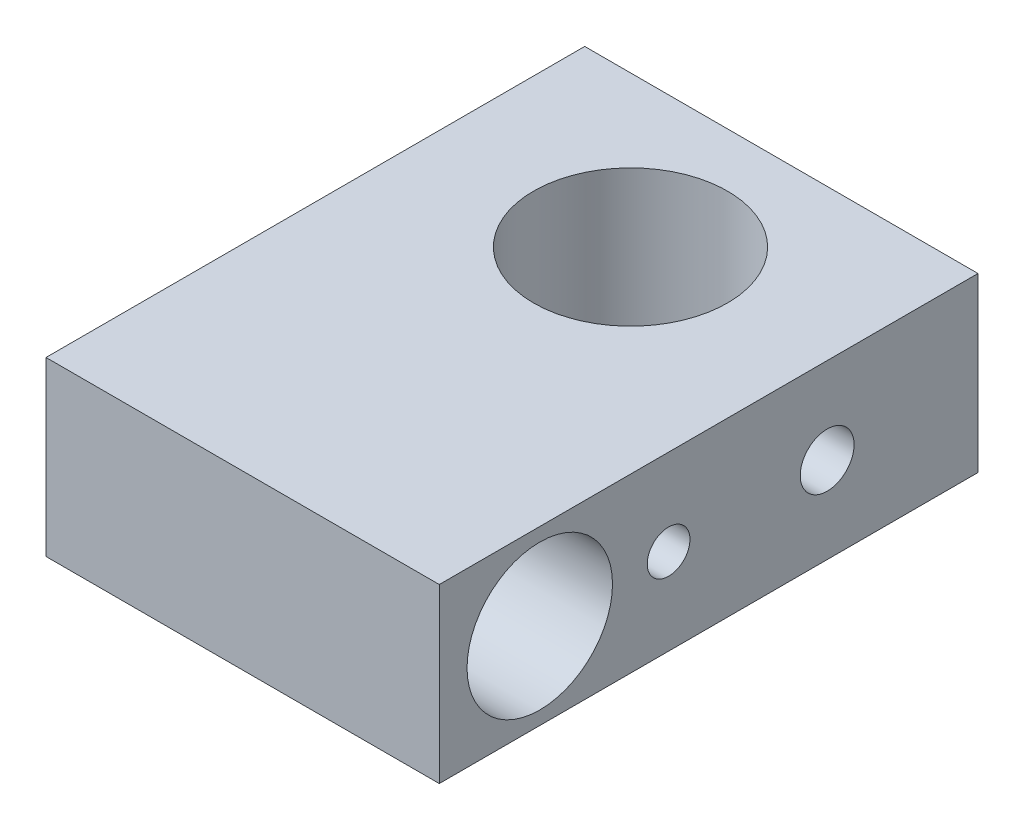
ISO-10303-21;
HEADER;
FILE_DESCRIPTION(('STEP AP214'),'2;1');
FILE_NAME('part.step','',(''),(''),'','','');
FILE_SCHEMA(('AUTOMOTIVE_DESIGN { 1 0 10303 214 1 1 1 1 }'));
ENDSEC;
DATA;
#1=APPLICATION_CONTEXT('core data for automotive mechanical design processes');
#2=APPLICATION_PROTOCOL_DEFINITION('international standard','automotive_design',2000,#1);
#3=PRODUCT_CONTEXT('',#1,'mechanical');
#4=PRODUCT('Part','Part','',(#3));
#5=PRODUCT_RELATED_PRODUCT_CATEGORY('part','',(#4));
#6=PRODUCT_DEFINITION_FORMATION('','',#4);
#7=PRODUCT_DEFINITION_CONTEXT('part definition',#1,'design');
#8=PRODUCT_DEFINITION('design','',#6,#7);
#9=PRODUCT_DEFINITION_SHAPE('','',#8);
#10=(LENGTH_UNIT() NAMED_UNIT(*) SI_UNIT(.MILLI.,.METRE.));
#11=(NAMED_UNIT(*) PLANE_ANGLE_UNIT() SI_UNIT($,.RADIAN.));
#12=(NAMED_UNIT(*) SI_UNIT($,.STERADIAN.) SOLID_ANGLE_UNIT());
#13=UNCERTAINTY_MEASURE_WITH_UNIT(LENGTH_MEASURE(1.E-05),#10,'distance_accuracy_value','');
#14=(GEOMETRIC_REPRESENTATION_CONTEXT(3) GLOBAL_UNCERTAINTY_ASSIGNED_CONTEXT((#13)) GLOBAL_UNIT_ASSIGNED_CONTEXT((#10,
#11,#12)) REPRESENTATION_CONTEXT('',''));
#15=CARTESIAN_POINT('',(0.,0.,0.));
#16=DIRECTION('',(0.,0.,1.));
#17=DIRECTION('',(1.,0.,0.));
#18=AXIS2_PLACEMENT_3D('',#15,#16,#17);
#19=CARTESIAN_POINT('',(-9.125,8.,-7.));
#20=DIRECTION('',(0.,0.,1.));
#21=DIRECTION('',(1.,0.,0.));
#22=AXIS2_PLACEMENT_3D('',#19,#20,#21);
#23=PLANE('',#22);
#24=DIRECTION('',(-1.,0.,0.));
#25=VECTOR('',#24,1.);
#26=CARTESIAN_POINT('',(-9.125,0.,-7.));
#27=LINE('',#26,#25);
#28=CARTESIAN_POINT('',(9.125,0.,-6.99999999999999));
#29=VERTEX_POINT('',#28);
#30=CARTESIAN_POINT('',(-9.125,0.,-7.));
#31=VERTEX_POINT('',#30);
#32=EDGE_CURVE('E117',#29,#31,#27,.T.);
#33=ORIENTED_EDGE('',*,*,#32,.T.);
#34=DIRECTION('',(0.,-1.,0.));
#35=VECTOR('',#34,1.);
#36=CARTESIAN_POINT('',(-9.125,8.,-7.));
#37=LINE('',#36,#35);
#38=CARTESIAN_POINT('',(-9.125,8.,-7.));
#39=VERTEX_POINT('',#38);
#40=EDGE_CURVE('E13',#39,#31,#37,.T.);
#41=ORIENTED_EDGE('',*,*,#40,.F.);
#42=DIRECTION('',(-1.,0.,0.));
#43=VECTOR('',#42,1.);
#44=CARTESIAN_POINT('',(-9.125,8.,-7.));
#45=LINE('',#44,#43);
#46=CARTESIAN_POINT('',(9.125,8.,-6.99999999999999));
#47=VERTEX_POINT('',#46);
#48=EDGE_CURVE('E104',#47,#39,#45,.T.);
#49=ORIENTED_EDGE('',*,*,#48,.F.);
#50=DIRECTION('',(0.,-1.,0.));
#51=VECTOR('',#50,1.);
#52=CARTESIAN_POINT('',(9.125,8.,-6.99999999999999));
#53=LINE('',#52,#51);
#54=EDGE_CURVE('E113',#47,#29,#53,.T.);
#55=ORIENTED_EDGE('',*,*,#54,.T.);
#56=EDGE_LOOP('',(#33,#41,#49,#55));
#57=FACE_BOUND('',#56,.T.);
#58=ADVANCED_FACE('F48',(#57),#23,.F.);
#59=CARTESIAN_POINT('',(-9.125,8.,18.));
#60=DIRECTION('',(1.,0.,0.));
#61=DIRECTION('',(0.,0.,-1.));
#62=AXIS2_PLACEMENT_3D('',#59,#60,#61);
#63=PLANE('',#62);
#64=CARTESIAN_POINT('',(-9.125,4.,7.3575));
#65=DIRECTION('',(1.,0.,0.));
#66=DIRECTION('',(0.,0.,-1.));
#67=AXIS2_PLACEMENT_3D('',#64,#65,#66);
#68=CIRCLE('',#67,0.990599999999999);
#69=CARTESIAN_POINT('',(-9.125,4.,6.3669));
#70=VERTEX_POINT('',#69);
#71=EDGE_CURVE('E140',#70,#70,#68,.T.);
#72=ORIENTED_EDGE('',*,*,#71,.T.);
#73=EDGE_LOOP('',(#72));
#74=FACE_BOUND('',#73,.T.);
#75=CARTESIAN_POINT('',(-9.125,4.,13.336186812336));
#76=DIRECTION('',(1.,0.,0.));
#77=DIRECTION('',(0.,0.,-1.));
#78=AXIS2_PLACEMENT_3D('',#75,#76,#77);
#79=CIRCLE('',#78,3.375);
#80=CARTESIAN_POINT('',(-9.125,4.,9.96118681233597));
#81=VERTEX_POINT('',#80);
#82=EDGE_CURVE('E136',#81,#81,#79,.T.);
#83=ORIENTED_EDGE('',*,*,#82,.T.);
#84=EDGE_LOOP('',(#83));
#85=FACE_BOUND('',#84,.T.);
#86=DIRECTION('',(0.,0.,1.));
#87=VECTOR('',#86,1.);
#88=CARTESIAN_POINT('',(-9.125,0.,18.));
#89=LINE('',#88,#87);
#90=CARTESIAN_POINT('',(-9.125,0.,18.));
#91=VERTEX_POINT('',#90);
#92=EDGE_CURVE('E108',#31,#91,#89,.T.);
#93=ORIENTED_EDGE('',*,*,#92,.T.);
#94=DIRECTION('',(0.,-1.,0.));
#95=VECTOR('',#94,1.);
#96=CARTESIAN_POINT('',(-9.125,8.,18.));
#97=LINE('',#96,#95);
#98=CARTESIAN_POINT('',(-9.125,8.,18.));
#99=VERTEX_POINT('',#98);
#100=EDGE_CURVE('E61',#99,#91,#97,.T.);
#101=ORIENTED_EDGE('',*,*,#100,.F.);
#102=DIRECTION('',(0.,0.,1.));
#103=VECTOR('',#102,1.);
#104=CARTESIAN_POINT('',(-9.125,8.,18.));
#105=LINE('',#104,#103);
#106=EDGE_CURVE('E99',#39,#99,#105,.T.);
#107=ORIENTED_EDGE('',*,*,#106,.F.);
#108=ORIENTED_EDGE('',*,*,#40,.T.);
#109=EDGE_LOOP('',(#93,#101,#107,#108));
#110=FACE_BOUND('',#109,.T.);
#111=ADVANCED_FACE('F107',(#74,#85,#110),#63,.F.);
#112=CARTESIAN_POINT('',(9.125,8.,18.));
#113=DIRECTION('',(0.,0.,-1.));
#114=DIRECTION('',(-1.,0.,0.));
#115=AXIS2_PLACEMENT_3D('',#112,#113,#114);
#116=PLANE('',#115);
#117=DIRECTION('',(1.,0.,0.));
#118=VECTOR('',#117,1.);
#119=CARTESIAN_POINT('',(9.125,0.,18.));
#120=LINE('',#119,#118);
#121=CARTESIAN_POINT('',(9.125,0.,18.));
#122=VERTEX_POINT('',#121);
#123=EDGE_CURVE('E86',#91,#122,#120,.T.);
#124=ORIENTED_EDGE('',*,*,#123,.T.);
#125=DIRECTION('',(0.,-1.,0.));
#126=VECTOR('',#125,1.);
#127=CARTESIAN_POINT('',(9.125,8.,18.));
#128=LINE('',#127,#126);
#129=CARTESIAN_POINT('',(9.125,8.,18.));
#130=VERTEX_POINT('',#129);
#131=EDGE_CURVE('E109',#130,#122,#128,.T.);
#132=ORIENTED_EDGE('',*,*,#131,.F.);
#133=DIRECTION('',(1.,0.,0.));
#134=VECTOR('',#133,1.);
#135=CARTESIAN_POINT('',(9.125,8.,18.));
#136=LINE('',#135,#134);
#137=EDGE_CURVE('E102',#99,#130,#136,.T.);
#138=ORIENTED_EDGE('',*,*,#137,.F.);
#139=ORIENTED_EDGE('',*,*,#100,.T.);
#140=EDGE_LOOP('',(#124,#132,#138,#139));
#141=FACE_BOUND('',#140,.T.);
#142=ADVANCED_FACE('F111',(#141),#116,.F.);
#143=CARTESIAN_POINT('',(9.125,8.,-6.99999999999999));
#144=DIRECTION('',(-1.,0.,0.));
#145=DIRECTION('',(0.,0.,1.));
#146=AXIS2_PLACEMENT_3D('',#143,#144,#145);
#147=PLANE('',#146);
#148=CARTESIAN_POINT('',(9.125,4.,0.));
#149=DIRECTION('',(1.,0.,0.));
#150=DIRECTION('',(0.,0.,-1.));
#151=AXIS2_PLACEMENT_3D('',#148,#149,#150);
#152=CIRCLE('',#151,1.24999999999999);
#153=CARTESIAN_POINT('',(9.125,4.,-1.24999999999999));
#154=VERTEX_POINT('',#153);
#155=EDGE_CURVE('E148',#154,#154,#152,.T.);
#156=ORIENTED_EDGE('',*,*,#155,.F.);
#157=EDGE_LOOP('',(#156));
#158=FACE_BOUND('',#157,.T.);
#159=CARTESIAN_POINT('',(9.125,4.,7.3575));
#160=DIRECTION('',(1.,0.,0.));
#161=DIRECTION('',(0.,0.,-1.));
#162=AXIS2_PLACEMENT_3D('',#159,#160,#161);
#163=CIRCLE('',#162,0.990599999999999);
#164=CARTESIAN_POINT('',(9.125,4.,6.3669));
#165=VERTEX_POINT('',#164);
#166=EDGE_CURVE('E143',#165,#165,#163,.T.);
#167=ORIENTED_EDGE('',*,*,#166,.F.);
#168=EDGE_LOOP('',(#167));
#169=FACE_BOUND('',#168,.T.);
#170=CARTESIAN_POINT('',(9.125,4.,13.336186812336));
#171=DIRECTION('',(1.,0.,0.));
#172=DIRECTION('',(0.,0.,-1.));
#173=AXIS2_PLACEMENT_3D('',#170,#171,#172);
#174=CIRCLE('',#173,3.375);
#175=CARTESIAN_POINT('',(9.125,4.,9.96118681233597));
#176=VERTEX_POINT('',#175);
#177=EDGE_CURVE('E137',#176,#176,#174,.T.);
#178=ORIENTED_EDGE('',*,*,#177,.F.);
#179=EDGE_LOOP('',(#178));
#180=FACE_BOUND('',#179,.T.);
#181=DIRECTION('',(0.,0.,-1.));
#182=VECTOR('',#181,1.);
#183=CARTESIAN_POINT('',(9.125,0.,-6.99999999999999));
#184=LINE('',#183,#182);
#185=EDGE_CURVE('E92',#122,#29,#184,.T.);
#186=ORIENTED_EDGE('',*,*,#185,.T.);
#187=ORIENTED_EDGE('',*,*,#54,.F.);
#188=DIRECTION('',(0.,0.,-1.));
#189=VECTOR('',#188,1.);
#190=CARTESIAN_POINT('',(9.125,8.,-6.99999999999999));
#191=LINE('',#190,#189);
#192=EDGE_CURVE('E69',#130,#47,#191,.T.);
#193=ORIENTED_EDGE('',*,*,#192,.F.);
#194=ORIENTED_EDGE('',*,*,#131,.T.);
#195=EDGE_LOOP('',(#186,#187,#193,#194));
#196=FACE_BOUND('',#195,.T.);
#197=ADVANCED_FACE('F125',(#158,#169,#180,#196),#147,.F.);
#198=CARTESIAN_POINT('',(9.125,8.,-6.99999999999999));
#199=DIRECTION('',(0.,-1.,0.));
#200=DIRECTION('',(0.,0.,-1.));
#201=AXIS2_PLACEMENT_3D('',#198,#199,#200);
#202=PLANE('',#201);
#203=CARTESIAN_POINT('',(0.,8.,0.));
#204=DIRECTION('',(0.,1.,0.));
#205=DIRECTION('',(0.,0.,1.));
#206=AXIS2_PLACEMENT_3D('',#203,#204,#205);
#207=CIRCLE('',#206,4.5);
#208=CARTESIAN_POINT('',(0.,8.,4.5));
#209=VERTEX_POINT('',#208);
#210=EDGE_CURVE('E133',#209,#209,#207,.T.);
#211=ORIENTED_EDGE('',*,*,#210,.F.);
#212=EDGE_LOOP('',(#211));
#213=FACE_BOUND('',#212,.T.);
#214=ORIENTED_EDGE('',*,*,#48,.T.);
#215=ORIENTED_EDGE('',*,*,#106,.T.);
#216=ORIENTED_EDGE('',*,*,#137,.T.);
#217=ORIENTED_EDGE('',*,*,#192,.T.);
#218=EDGE_LOOP('',(#214,#215,#216,#217));
#219=FACE_BOUND('',#218,.T.);
#220=ADVANCED_FACE('F100',(#213,#219),#202,.F.);
#221=CARTESIAN_POINT('',(9.125,0.,-6.99999999999999));
#222=DIRECTION('',(0.,-1.,0.));
#223=DIRECTION('',(0.,0.,-1.));
#224=AXIS2_PLACEMENT_3D('',#221,#222,#223);
#225=PLANE('',#224);
#226=CARTESIAN_POINT('',(0.,0.,0.));
#227=DIRECTION('',(0.,1.,0.));
#228=DIRECTION('',(0.,0.,1.));
#229=AXIS2_PLACEMENT_3D('',#226,#227,#228);
#230=CIRCLE('',#229,4.5);
#231=CARTESIAN_POINT('',(0.,0.,4.5));
#232=VERTEX_POINT('',#231);
#233=EDGE_CURVE('E120',#232,#232,#230,.T.);
#234=ORIENTED_EDGE('',*,*,#233,.T.);
#235=EDGE_LOOP('',(#234));
#236=FACE_BOUND('',#235,.T.);
#237=ORIENTED_EDGE('',*,*,#32,.F.);
#238=ORIENTED_EDGE('',*,*,#185,.F.);
#239=ORIENTED_EDGE('',*,*,#123,.F.);
#240=ORIENTED_EDGE('',*,*,#92,.F.);
#241=EDGE_LOOP('',(#237,#238,#239,#240));
#242=FACE_BOUND('',#241,.T.);
#243=ADVANCED_FACE('F128',(#236,#242),#225,.T.);
#244=CARTESIAN_POINT('',(0.,8.,0.));
#245=DIRECTION('',(0.,1.,0.));
#246=DIRECTION('',(0.,0.,1.));
#247=AXIS2_PLACEMENT_3D('',#244,#245,#246);
#248=CYLINDRICAL_SURFACE('',#247,4.5);
#249=CARTESIAN_POINT('',(4.32290411644765,4.,-1.24999999999999));
#250=CARTESIAN_POINT('',(4.32290518747009,4.06874347664407,-1.24999857498244));
#251=CARTESIAN_POINT('',(4.32456180468303,4.13750162003629,-1.24430988712604));
#252=CARTESIAN_POINT('',(4.33098737036507,4.27302429771584,-1.22175346858591));
#253=CARTESIAN_POINT('',(4.3357577089319,4.33978792763889,-1.20488074482037));
#254=CARTESIAN_POINT('',(4.3478296771143,4.46934116337968,-1.16056004340387));
#255=CARTESIAN_POINT('',(4.35512753927727,4.53213652037682,-1.13312779872145));
#256=CARTESIAN_POINT('',(4.37142737531087,4.65224546102772,-1.06851688708743));
#257=CARTESIAN_POINT('',(4.38042952222604,4.70955848714271,-1.03133723028468));
#258=CARTESIAN_POINT('',(4.39939741122667,4.81863092779141,-0.947207659537754));
#259=CARTESIAN_POINT('',(4.40938137769938,4.87021955881808,-0.900040389354678));
#260=CARTESIAN_POINT('',(4.42903119907275,4.96486541951966,-0.797741434800136));
#261=CARTESIAN_POINT('',(4.43869701848036,5.00792169998249,-0.742608865478607));
#262=CARTESIAN_POINT('',(4.45682601370986,5.0850022305806,-0.624750214452995));
#263=CARTESIAN_POINT('',(4.46526519213644,5.1188552959222,-0.561908163805414));
#264=CARTESIAN_POINT('',(4.47978009156482,5.17544963687985,-0.43115018102471));
#265=CARTESIAN_POINT('',(4.48585624638467,5.19819295228698,-0.363235182945445));
#266=CARTESIAN_POINT('',(4.49483159170207,5.23136547273629,-0.22604318010293));
#267=CARTESIAN_POINT('',(4.49780569025351,5.24208552113064,-0.156841487533507));
#268=CARTESIAN_POINT('',(4.50050433692141,5.25182372832801,-0.0175622284393638));
#269=CARTESIAN_POINT('',(4.50022947337466,5.25084400577835,0.0525151772113882));
#270=CARTESIAN_POINT('',(4.49651543187108,5.23741222380809,0.189527123576271));
#271=CARTESIAN_POINT('',(4.49316299037632,5.22527461801546,0.256495205022548));
#272=CARTESIAN_POINT('',(4.48377380049515,5.19038143088372,0.387403741661239));
#273=CARTESIAN_POINT('',(4.47773689287314,5.16762521967245,0.451344017003042));
#274=CARTESIAN_POINT('',(4.46353125303123,5.11190895970842,0.575166795899739));
#275=CARTESIAN_POINT('',(4.45534075392173,5.07884404523786,0.634999513293937));
#276=CARTESIAN_POINT('',(4.43770610675039,5.00353019209011,0.748372286544126));
#277=CARTESIAN_POINT('',(4.42826169679617,4.96127933365402,0.801911023420059));
#278=CARTESIAN_POINT('',(4.40876831613152,4.86713567111137,0.903053380191145));
#279=CARTESIAN_POINT('',(4.39870968477246,4.81496909717709,0.950400625294901));
#280=CARTESIAN_POINT('',(4.37940191575936,4.70333366243893,1.03574054042555));
#281=CARTESIAN_POINT('',(4.37015283657441,4.64386427494092,1.07373253513776));
#282=CARTESIAN_POINT('',(4.35347006971972,4.51871763929374,1.13950119060978));
#283=CARTESIAN_POINT('',(4.34604990034146,4.45299886534662,1.16720250820497));
#284=CARTESIAN_POINT('',(4.33403011245413,4.31757820212117,1.21107648821783));
#285=CARTESIAN_POINT('',(4.32942972536695,4.24787740387666,1.22725229229959));
#286=CARTESIAN_POINT('',(4.3237357416584,4.10888274300589,1.2471622774305));
#287=CARTESIAN_POINT('',(4.32253373160699,4.03964838260269,1.25128124671117));
#288=CARTESIAN_POINT('',(4.32347494363827,3.90147900477792,1.24802546030741));
#289=CARTESIAN_POINT('',(4.32561777484271,3.83254395332308,1.24065204762324));
#290=CARTESIAN_POINT('',(4.33290194955527,3.69845112665,1.21496120714198));
#291=CARTESIAN_POINT('',(4.33797843412408,3.63324416557524,1.19688029932166));
#292=CARTESIAN_POINT('',(4.35049332079077,3.50678988645073,1.15055629594163));
#293=CARTESIAN_POINT('',(4.35793205025995,3.44554311864051,1.12231179178945));
#294=CARTESIAN_POINT('',(4.3745518120738,3.3271523157208,1.05569785607915));
#295=CARTESIAN_POINT('',(4.38376979927329,3.27013911448082,1.0171053363244));
#296=CARTESIAN_POINT('',(4.40282499705416,3.16325687796222,0.931163609237375));
#297=CARTESIAN_POINT('',(4.41266233402014,3.1133893076678,0.883812610803317));
#298=CARTESIAN_POINT('',(4.43222509969555,3.02058926471576,0.779908718233589));
#299=CARTESIAN_POINT('',(4.44193710647941,2.97792659496611,0.7231117993549));
#300=CARTESIAN_POINT('',(4.45983701439328,2.90273801446128,0.60294155643474));
#301=CARTESIAN_POINT('',(4.46802499626981,2.87021156660292,0.539568581085915));
#302=CARTESIAN_POINT('',(4.48190163893738,2.8165252040883,0.408489197616626));
#303=CARTESIAN_POINT('',(4.4876091198969,2.7952794169664,0.340820050525331));
#304=CARTESIAN_POINT('',(4.49596471419449,2.76451591327963,0.202688156447678));
#305=CARTESIAN_POINT('',(4.49861356791422,2.75499535842819,0.132226089798136));
#306=CARTESIAN_POINT('',(4.50051521104671,2.74814283515687,-0.00698007617882684));
#307=CARTESIAN_POINT('',(4.49987784493188,2.75041664645469,-0.0757035322948377));
#308=CARTESIAN_POINT('',(4.49553044423232,2.7661642812453,-0.211750309863844));
#309=CARTESIAN_POINT('',(4.49182054296648,2.77963761878491,-0.279073691936853));
#310=CARTESIAN_POINT('',(4.48176992045676,2.81717161181419,-0.409892491734701));
#311=CARTESIAN_POINT('',(4.47545058468407,2.84114629896691,-0.473414328140755));
#312=CARTESIAN_POINT('',(4.46083910148551,2.8989259691153,-0.595569603941377));
#313=CARTESIAN_POINT('',(4.45254666017165,2.93273241668827,-0.654202313356981));
#314=CARTESIAN_POINT('',(4.43457698674557,3.01033597135891,-0.766725560865266));
#315=CARTESIAN_POINT('',(4.424867058695,3.05439004303832,-0.820433633237655));
#316=CARTESIAN_POINT('',(4.40527960400557,3.15075896522179,-0.919827817865875));
#317=CARTESIAN_POINT('',(4.39540203270303,3.20307604900885,-0.965511754330251));
#318=CARTESIAN_POINT('',(4.37631776775268,3.31602225873568,-1.04867120954826));
#319=CARTESIAN_POINT('',(4.36713335303392,3.37682319482004,-1.08591898377727));
#320=CARTESIAN_POINT('',(4.35080192911572,3.50407199364414,-1.14961326326321));
#321=CARTESIAN_POINT('',(4.3436536973308,3.57051643660506,-1.17606625417816));
#322=CARTESIAN_POINT('',(4.33310672877768,3.69718006485862,-1.21429747440484));
#323=CARTESIAN_POINT('',(4.32931330336833,3.75689470277538,-1.22765281702806));
#324=CARTESIAN_POINT('',(4.32421169234928,3.87773582411498,-1.24550410246029));
#325=CARTESIAN_POINT('',(4.32290316392016,3.93886211160701,-1.25000126735755));
#326=CARTESIAN_POINT('',(4.32290411644765,4.,-1.24999999999999));
#327=B_SPLINE_CURVE_WITH_KNOTS('',3,(#249,#250,#251,#252,#253,#254,#255,#256,#257,#258,#259,
#260,#261,#262,#263,#264,#265,#266,#267,#268,#269,#270,#271,#272,#273,#274,#275,#276,#277,#278,
#279,#280,#281,#282,#283,#284,#285,#286,#287,#288,#289,#290,#291,#292,#293,#294,#295,#296,#297,
#298,#299,#300,#301,#302,#303,#304,#305,#306,#307,#308,#309,#310,#311,#312,#313,#314,#315,#316,
#317,#318,#319,#320,#321,#322,#323,#324,#325,#326),.UNSPECIFIED.,.T.,.F.,(4,2,2,2,2,2,2,2,2,2,2,
2,2,2,2,2,2,2,2,2,2,2,2,2,2,2,2,2,2,2,2,2,2,2,2,2,2,2,4),(0.,0.206005395844479,
0.412102824227255,0.617894362639283,0.823706807313077,1.03456947880015,1.24545559531202,
1.46003098375315,1.67456696053961,1.88379315612369,2.0929814646586,2.2964493375904,
2.49992928132027,2.70555066651714,2.91121506564782,3.1237143777574,3.33622902477099,
3.55027028703841,3.76425318285943,3.97132818882306,4.17837899780674,4.38101838846582,
4.58368587413353,4.79113333818942,4.99862327207954,5.21268753129668,5.42674044564047,
5.6391396626541,5.85148745480912,6.05678432365221,6.26207228502409,6.46571019932812,
6.66937846387954,6.87884344725016,7.08836514088844,7.30300439729125,7.51751450485882,
7.7007533147874,7.88396684302812),.UNSPECIFIED.);
#328=CARTESIAN_POINT('',(4.32290411644765,4.,-1.24999999999999));
#329=VERTEX_POINT('',#328);
#330=EDGE_CURVE('E51',#329,#329,#327,.T.);
#331=ORIENTED_EDGE('',*,*,#330,.T.);
#332=EDGE_LOOP('',(#331));
#333=FACE_BOUND('',#332,.T.);
#334=ORIENTED_EDGE('',*,*,#233,.F.);
#335=EDGE_LOOP('',(#334));
#336=FACE_BOUND('',#335,.T.);
#337=ORIENTED_EDGE('',*,*,#210,.T.);
#338=EDGE_LOOP('',(#337));
#339=FACE_BOUND('',#338,.T.);
#340=ADVANCED_FACE('F155',(#333,#336,#339),#248,.F.);
#341=CARTESIAN_POINT('',(-9.125,4.,13.336186812336));
#342=DIRECTION('',(1.,0.,0.));
#343=DIRECTION('',(0.,0.,-1.));
#344=AXIS2_PLACEMENT_3D('',#341,#342,#343);
#345=CYLINDRICAL_SURFACE('',#344,3.375);
#346=ORIENTED_EDGE('',*,*,#82,.F.);
#347=EDGE_LOOP('',(#346));
#348=FACE_BOUND('',#347,.T.);
#349=ORIENTED_EDGE('',*,*,#177,.T.);
#350=EDGE_LOOP('',(#349));
#351=FACE_BOUND('',#350,.T.);
#352=ADVANCED_FACE('F164',(#348,#351),#345,.F.);
#353=CARTESIAN_POINT('',(-9.125,4.,7.3575));
#354=DIRECTION('',(1.,0.,0.));
#355=DIRECTION('',(0.,0.,-1.));
#356=AXIS2_PLACEMENT_3D('',#353,#354,#355);
#357=CYLINDRICAL_SURFACE('',#356,0.990599999999999);
#358=ORIENTED_EDGE('',*,*,#71,.F.);
#359=EDGE_LOOP('',(#358));
#360=FACE_BOUND('',#359,.T.);
#361=ORIENTED_EDGE('',*,*,#166,.T.);
#362=EDGE_LOOP('',(#361));
#363=FACE_BOUND('',#362,.T.);
#364=ADVANCED_FACE('F160',(#360,#363),#357,.F.);
#365=CARTESIAN_POINT('',(9.125,4.,0.));
#366=DIRECTION('',(1.,0.,0.));
#367=DIRECTION('',(0.,0.,-1.));
#368=AXIS2_PLACEMENT_3D('',#365,#366,#367);
#369=CYLINDRICAL_SURFACE('',#368,1.24999999999999);
#370=ORIENTED_EDGE('',*,*,#155,.T.);
#371=EDGE_LOOP('',(#370));
#372=FACE_BOUND('',#371,.T.);
#373=ORIENTED_EDGE('',*,*,#330,.F.);
#374=EDGE_LOOP('',(#373));
#375=FACE_BOUND('',#374,.T.);
#376=ADVANCED_FACE('F158',(#372,#375),#369,.F.);
#377=CLOSED_SHELL('',(#58,#111,#142,#197,#220,#243,#340,#352,#364,#376));
#378=MANIFOLD_SOLID_BREP('B2',#377);
#379=ADVANCED_BREP_SHAPE_REPRESENTATION('',(#18,#378),#14);
#380=SHAPE_DEFINITION_REPRESENTATION(#9,#379);
ENDSEC;
END-ISO-10303-21;
